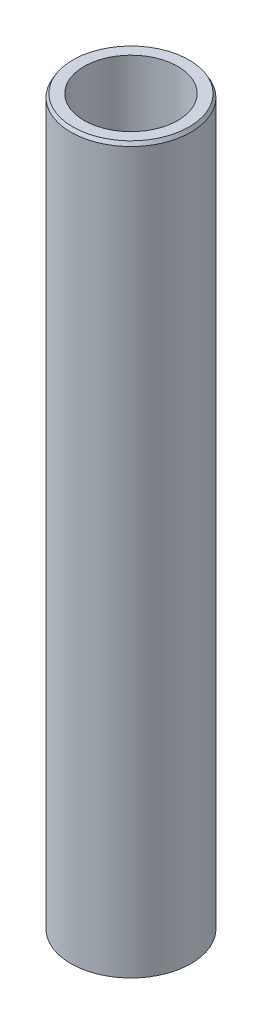
ISO-10303-21;
HEADER;
FILE_DESCRIPTION(('STEP AP214'),'2;1');
FILE_NAME('part.step','',(''),(''),'','','');
FILE_SCHEMA(('AUTOMOTIVE_DESIGN { 1 0 10303 214 1 1 1 1 }'));
ENDSEC;
DATA;
#1=APPLICATION_CONTEXT('core data for automotive mechanical design processes');
#2=APPLICATION_PROTOCOL_DEFINITION('international standard','automotive_design',2000,#1);
#3=PRODUCT_CONTEXT('',#1,'mechanical');
#4=PRODUCT('Part','Part','',(#3));
#5=PRODUCT_RELATED_PRODUCT_CATEGORY('part','',(#4));
#6=PRODUCT_DEFINITION_FORMATION('','',#4);
#7=PRODUCT_DEFINITION_CONTEXT('part definition',#1,'design');
#8=PRODUCT_DEFINITION('design','',#6,#7);
#9=PRODUCT_DEFINITION_SHAPE('','',#8);
#10=(LENGTH_UNIT() NAMED_UNIT(*) SI_UNIT(.MILLI.,.METRE.));
#11=(NAMED_UNIT(*) PLANE_ANGLE_UNIT() SI_UNIT($,.RADIAN.));
#12=(NAMED_UNIT(*) SI_UNIT($,.STERADIAN.) SOLID_ANGLE_UNIT());
#13=UNCERTAINTY_MEASURE_WITH_UNIT(LENGTH_MEASURE(1.E-05),#10,'distance_accuracy_value','');
#14=(GEOMETRIC_REPRESENTATION_CONTEXT(3) GLOBAL_UNCERTAINTY_ASSIGNED_CONTEXT((#13)) GLOBAL_UNIT_ASSIGNED_CONTEXT((#10,
#11,#12)) REPRESENTATION_CONTEXT('',''));
#15=CARTESIAN_POINT('',(0.,0.,0.));
#16=DIRECTION('',(0.,0.,1.));
#17=DIRECTION('',(1.,0.,0.));
#18=AXIS2_PLACEMENT_3D('',#15,#16,#17);
#19=CARTESIAN_POINT('',(0.,543.138858770913,0.));
#20=DIRECTION('',(0.,-1.,0.));
#21=DIRECTION('',(0.,0.,-1.));
#22=AXIS2_PLACEMENT_3D('',#19,#20,#21);
#23=CYLINDRICAL_SURFACE('',#22,45.);
#24=CARTESIAN_POINT('',(0.,540.504047697418,0.));
#25=DIRECTION('',(0.,1.,0.));
#26=DIRECTION('',(0.,0.,1.));
#27=AXIS2_PLACEMENT_3D('',#24,#25,#26);
#28=CIRCLE('',#27,45.);
#29=CARTESIAN_POINT('',(0.,540.504047697418,45.));
#30=VERTEX_POINT('',#29);
#31=EDGE_CURVE('E50',#30,#30,#28,.F.);
#32=ORIENTED_EDGE('',*,*,#31,.T.);
#33=EDGE_LOOP('',(#32));
#34=FACE_BOUND('',#33,.T.);
#35=CARTESIAN_POINT('',(0.,1.52120888254637,0.));
#36=DIRECTION('',(0.,1.,0.));
#37=DIRECTION('',(0.,0.,1.));
#38=AXIS2_PLACEMENT_3D('',#35,#36,#37);
#39=CIRCLE('',#38,45.);
#40=CARTESIAN_POINT('',(0.,1.52120888254637,45.));
#41=VERTEX_POINT('',#40);
#42=EDGE_CURVE('E51',#41,#41,#39,.T.);
#43=ORIENTED_EDGE('',*,*,#42,.T.);
#44=EDGE_LOOP('',(#43));
#45=FACE_BOUND('',#44,.T.);
#46=ADVANCED_FACE('F39',(#34,#45),#23,.T.);
#47=CARTESIAN_POINT('',(0.,543.138858770913,0.));
#48=DIRECTION('',(0.,1.,0.));
#49=DIRECTION('',(0.,0.,1.));
#50=AXIS2_PLACEMENT_3D('',#47,#48,#49);
#51=PLANE('',#50);
#52=CARTESIAN_POINT('',(0.,543.138858770913,0.));
#53=DIRECTION('',(0.,1.,0.));
#54=DIRECTION('',(0.,0.,1.));
#55=AXIS2_PLACEMENT_3D('',#52,#53,#54);
#56=CIRCLE('',#55,43.4787911174537);
#57=CARTESIAN_POINT('',(0.,543.138858770913,43.4787911174537));
#58=VERTEX_POINT('',#57);
#59=EDGE_CURVE('E54',#58,#58,#56,.T.);
#60=ORIENTED_EDGE('',*,*,#59,.T.);
#61=EDGE_LOOP('',(#60));
#62=FACE_BOUND('',#61,.T.);
#63=CARTESIAN_POINT('',(0.,543.138858770913,0.));
#64=DIRECTION('',(0.,1.,0.));
#65=DIRECTION('',(0.,0.,1.));
#66=AXIS2_PLACEMENT_3D('',#63,#64,#65);
#67=CIRCLE('',#66,35.0774656538736);
#68=CARTESIAN_POINT('',(0.,543.138858770913,35.0774656538736));
#69=VERTEX_POINT('',#68);
#70=EDGE_CURVE('E58',#69,#69,#67,.T.);
#71=ORIENTED_EDGE('',*,*,#70,.F.);
#72=EDGE_LOOP('',(#71));
#73=FACE_BOUND('',#72,.T.);
#74=ADVANCED_FACE('F69',(#62,#73),#51,.T.);
#75=CARTESIAN_POINT('',(0.,0.,0.));
#76=DIRECTION('',(0.,1.,0.));
#77=DIRECTION('',(0.,0.,1.));
#78=AXIS2_PLACEMENT_3D('',#75,#76,#77);
#79=PLANE('',#78);
#80=CARTESIAN_POINT('',(0.,0.,0.));
#81=DIRECTION('',(0.,1.,0.));
#82=DIRECTION('',(0.,0.,1.));
#83=AXIS2_PLACEMENT_3D('',#80,#81,#82);
#84=CIRCLE('',#83,42.3651889265046);
#85=CARTESIAN_POINT('',(0.,0.,42.3651889265046));
#86=VERTEX_POINT('',#85);
#87=EDGE_CURVE('E10',#86,#86,#84,.F.);
#88=ORIENTED_EDGE('',*,*,#87,.T.);
#89=EDGE_LOOP('',(#88));
#90=FACE_BOUND('',#89,.T.);
#91=CARTESIAN_POINT('',(0.,0.,0.));
#92=DIRECTION('',(0.,1.,0.));
#93=DIRECTION('',(0.,0.,1.));
#94=AXIS2_PLACEMENT_3D('',#91,#92,#93);
#95=CIRCLE('',#94,35.0774656538736);
#96=CARTESIAN_POINT('',(0.,0.,35.0774656538736));
#97=VERTEX_POINT('',#96);
#98=EDGE_CURVE('E63',#97,#97,#95,.T.);
#99=ORIENTED_EDGE('',*,*,#98,.T.);
#100=EDGE_LOOP('',(#99));
#101=FACE_BOUND('',#100,.T.);
#102=ADVANCED_FACE('F75',(#90,#101),#79,.F.);
#103=CARTESIAN_POINT('',(0.,543.138858770913,0.));
#104=DIRECTION('',(0.,-1.,0.));
#105=DIRECTION('',(0.,0.,-1.));
#106=AXIS2_PLACEMENT_3D('',#103,#104,#105);
#107=CYLINDRICAL_SURFACE('',#106,35.0774656538736);
#108=ORIENTED_EDGE('',*,*,#70,.T.);
#109=EDGE_LOOP('',(#108));
#110=FACE_BOUND('',#109,.T.);
#111=ORIENTED_EDGE('',*,*,#98,.F.);
#112=EDGE_LOOP('',(#111));
#113=FACE_BOUND('',#112,.T.);
#114=ADVANCED_FACE('F70',(#110,#113),#107,.F.);
#115=CARTESIAN_POINT('',(0.,543.138858770913,0.));
#116=DIRECTION('',(0.,-1.,0.));
#117=DIRECTION('',(0.,0.,-1.));
#118=AXIS2_PLACEMENT_3D('',#115,#116,#117);
#119=CONICAL_SURFACE('',#118,43.4787911174537,0.523598775598306);
#120=ORIENTED_EDGE('',*,*,#31,.F.);
#121=EDGE_LOOP('',(#120));
#122=FACE_BOUND('',#121,.T.);
#123=ORIENTED_EDGE('',*,*,#59,.F.);
#124=EDGE_LOOP('',(#123));
#125=FACE_BOUND('',#124,.T.);
#126=ADVANCED_FACE('F81',(#122,#125),#119,.T.);
#127=CARTESIAN_POINT('',(0.,1.52120888254637,0.));
#128=DIRECTION('',(0.,1.,0.));
#129=DIRECTION('',(0.,0.,1.));
#130=AXIS2_PLACEMENT_3D('',#127,#128,#129);
#131=CONICAL_SURFACE('',#130,45.,1.0471975511966);
#132=CARTESIAN_POINT('',(0.,0.,42.3651889265046));
#133=CARTESIAN_POINT('',(0.,0.0158459258598561,42.3926348751868));
#134=CARTESIAN_POINT('',(0.,0.0316918517197146,42.4200808238691));
#135=CARTESIAN_POINT('',(0.,0.0633837034394318,42.4749727212336));
#136=CARTESIAN_POINT('',(0.,0.0792296292992903,42.5024186699158));
#137=CARTESIAN_POINT('',(0.,0.110921481019006,42.5573105672803));
#138=CARTESIAN_POINT('',(0.,0.126767406878863,42.5847565159625));
#139=CARTESIAN_POINT('',(0.,0.158459258598579,42.639648413327));
#140=CARTESIAN_POINT('',(0.,0.174305184458438,42.6670943620093));
#141=CARTESIAN_POINT('',(0.,0.205997036178154,42.7219862593738));
#142=CARTESIAN_POINT('',(0.,0.221842962038011,42.749432208056));
#143=CARTESIAN_POINT('',(0.,0.253534813757727,42.8043241054205));
#144=CARTESIAN_POINT('',(0.,0.269380739617586,42.8317700541027));
#145=CARTESIAN_POINT('',(0.,0.301072591337302,42.8866619514672));
#146=CARTESIAN_POINT('',(0.,0.31691851719716,42.9141079001495));
#147=CARTESIAN_POINT('',(0.,0.348610368916875,42.968999797514));
#148=CARTESIAN_POINT('',(0.,0.364456294776732,42.9964457461962));
#149=CARTESIAN_POINT('',(0.,0.396148146496449,43.0513376435607));
#150=CARTESIAN_POINT('',(0.,0.411994072356308,43.0787835922429));
#151=CARTESIAN_POINT('',(0.,0.443685924076023,43.1336754896074));
#152=CARTESIAN_POINT('',(0.,0.459531849935881,43.1611214382897));
#153=CARTESIAN_POINT('',(0.,0.491223701655596,43.2160133356542));
#154=CARTESIAN_POINT('',(0.,0.507069627515455,43.2434592843364));
#155=CARTESIAN_POINT('',(0.,0.538761479235172,43.2983511817009));
#156=CARTESIAN_POINT('',(0.,0.554607405095029,43.3257971303831));
#157=CARTESIAN_POINT('',(0.,0.586299256814745,43.3806890277476));
#158=CARTESIAN_POINT('',(0.,0.602145182674602,43.4081349764299));
#159=CARTESIAN_POINT('',(0.,0.633837034394318,43.4630268737943));
#160=CARTESIAN_POINT('',(0.,0.649682960254177,43.4904728224766));
#161=CARTESIAN_POINT('',(0.,0.681374811973893,43.5453647198411));
#162=CARTESIAN_POINT('',(0.,0.69722073783375,43.5728106685233));
#163=CARTESIAN_POINT('',(0.,0.728912589553466,43.6277025658878));
#164=CARTESIAN_POINT('',(0.,0.744758515413325,43.6551485145701));
#165=CARTESIAN_POINT('',(0.,0.776450367133041,43.7100404119345));
#166=CARTESIAN_POINT('',(0.,0.792296292992899,43.7374863606168));
#167=CARTESIAN_POINT('',(0.,0.823988144712614,43.7923782579813));
#168=CARTESIAN_POINT('',(0.,0.839834070572472,43.8198242066635));
#169=CARTESIAN_POINT('',(0.,0.871525922292188,43.874716104028));
#170=CARTESIAN_POINT('',(0.,0.887371848152047,43.9021620527102));
#171=CARTESIAN_POINT('',(0.,0.919063699871763,43.9570539500747));
#172=CARTESIAN_POINT('',(0.,0.93490962573162,43.984499898757));
#173=CARTESIAN_POINT('',(0.,0.966601477451336,44.0393917961215));
#174=CARTESIAN_POINT('',(0.,0.982447403311195,44.0668377448037));
#175=CARTESIAN_POINT('',(0.,1.01413925503091,44.1217296421682));
#176=CARTESIAN_POINT('',(0.,1.02998518089077,44.1491755908504));
#177=CARTESIAN_POINT('',(0.,1.06167703261048,44.2040674882149));
#178=CARTESIAN_POINT('',(0.,1.07752295847034,44.2315134368972));
#179=CARTESIAN_POINT('',(0.,1.10921481019006,44.2864053342617));
#180=CARTESIAN_POINT('',(0.,1.12506073604992,44.3138512829439));
#181=CARTESIAN_POINT('',(0.,1.15675258776963,44.3687431803084));
#182=CARTESIAN_POINT('',(0.,1.17259851362949,44.3961891289906));
#183=CARTESIAN_POINT('',(0.,1.20429036534921,44.4510810263551));
#184=CARTESIAN_POINT('',(0.,1.22013629120906,44.4785269750374));
#185=CARTESIAN_POINT('',(0.,1.25182814292878,44.5334188724019));
#186=CARTESIAN_POINT('',(0.,1.26767406878864,44.5608648210841));
#187=CARTESIAN_POINT('',(0.,1.29936592050835,44.6157567184486));
#188=CARTESIAN_POINT('',(0.,1.31521184636821,44.6432026671308));
#189=CARTESIAN_POINT('',(0.,1.34690369808793,44.6980945644953));
#190=CARTESIAN_POINT('',(0.,1.36274962394779,44.7255405131776));
#191=CARTESIAN_POINT('',(0.,1.3944414756675,44.7804324105421));
#192=CARTESIAN_POINT('',(0.,1.41028740152736,44.8078783592243));
#193=CARTESIAN_POINT('',(0.,1.44197925324707,44.8627702565888));
#194=CARTESIAN_POINT('',(0.,1.45782517910693,44.890216205271));
#195=CARTESIAN_POINT('',(0.,1.48951703082665,44.9451081026355));
#196=CARTESIAN_POINT('',(0.,1.50536295668651,44.9725540513178));
#197=CARTESIAN_POINT('',(0.,1.52120888254637,45.));
#198=B_SPLINE_CURVE_WITH_KNOTS('',3,(#132,#133,#134,#135,#136,#137,#138,#139,#140,#141,#142,
#143,#144,#145,#146,#147,#148,#149,#150,#151,#152,#153,#154,#155,#156,#157,#158,#159,#160,#161,
#162,#163,#164,#165,#166,#167,#168,#169,#170,#171,#172,#173,#174,#175,#176,#177,#178,#179,#180,
#181,#182,#183,#184,#185,#186,#187,#188,#189,#190,#191,#192,#193,#194,#195,#196,#197),
.UNSPECIFIED.,.F.,.F.,(4,2,2,2,2,2,2,2,2,2,2,2,2,2,2,2,2,2,2,2,2,2,2,2,2,2,2,2,2,2,2,2,4),(0.,
0.0950755551591511,0.190151110318296,0.285226665477447,0.380302220636592,0.475377775795743,
0.570453330954889,0.66552888611404,0.760604441273191,0.855679996432336,0.950755551591487,
1.04583110675063,1.14090666190978,1.23598221706893,1.33105777222808,1.42613332738723,
1.52120888254638,1.61628443770553,1.71135999286468,1.80643554802382,1.90151110318297,
1.99658665834212,2.09166221350127,2.18673776866042,2.28181332381957,2.37688887897872,
2.47196443413786,2.56703998929701,2.66211554445617,2.75719109961531,2.85226665477446,
2.94734220993361,3.04241776509276),.UNSPECIFIED.);
#199=EDGE_CURVE('BSEAM45',#86,#41,#198,.T.);
#200=ORIENTED_EDGE('',*,*,#87,.F.);
#201=ORIENTED_EDGE('',*,*,#42,.F.);
#202=ORIENTED_EDGE('',*,*,#199,.T.);
#203=ORIENTED_EDGE('',*,*,#199,.F.);
#204=EDGE_LOOP('',(#200,#202,#201,#203));
#205=FACE_BOUND('',#204,.T.);
#206=ADVANCED_FACE('F45',(#205),#131,.T.);
#207=CLOSED_SHELL('',(#46,#74,#102,#114,#126,#206));
#208=MANIFOLD_SOLID_BREP('B2',#207);
#209=ADVANCED_BREP_SHAPE_REPRESENTATION('',(#18,#208),#14);
#210=SHAPE_DEFINITION_REPRESENTATION(#9,#209);
ENDSEC;
END-ISO-10303-21;
